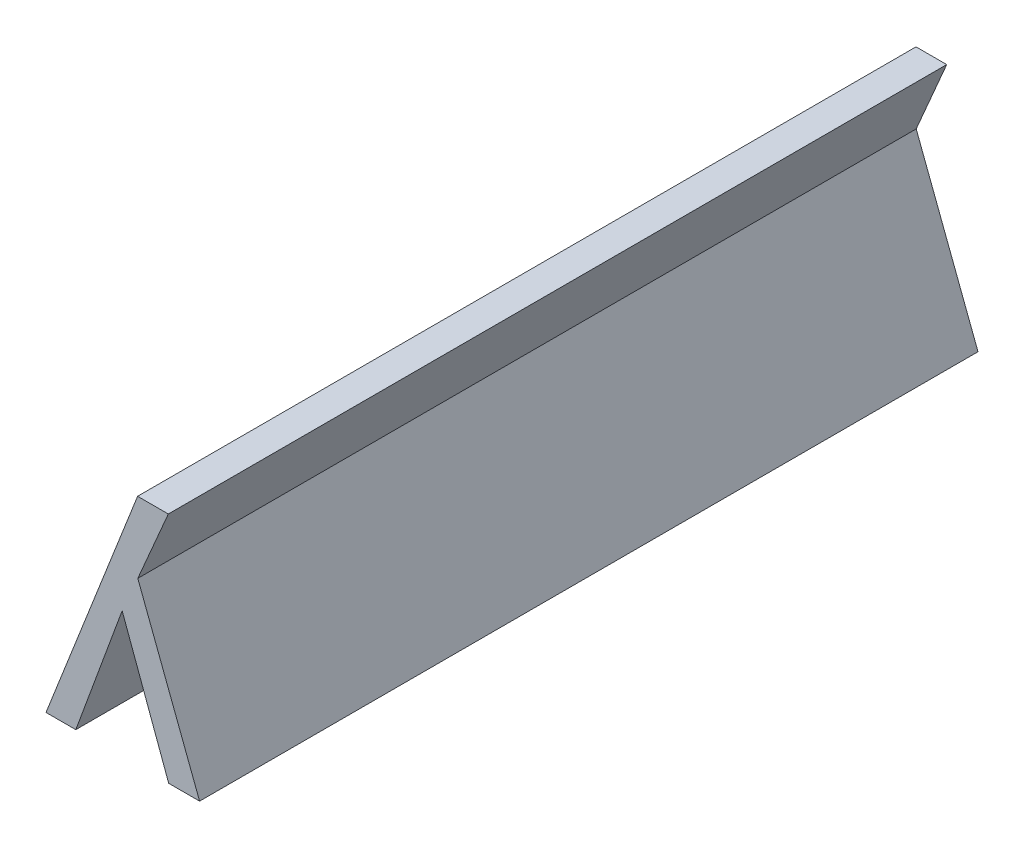
ISO-10303-21;
HEADER;
FILE_DESCRIPTION(('STEP AP214'),'2;1');
FILE_NAME('part.step','',(''),(''),'','','');
FILE_SCHEMA(('AUTOMOTIVE_DESIGN { 1 0 10303 214 1 1 1 1 }'));
ENDSEC;
DATA;
#1=APPLICATION_CONTEXT('core data for automotive mechanical design processes');
#2=APPLICATION_PROTOCOL_DEFINITION('international standard','automotive_design',2000,#1);
#3=PRODUCT_CONTEXT('',#1,'mechanical');
#4=PRODUCT('Part','Part','',(#3));
#5=PRODUCT_RELATED_PRODUCT_CATEGORY('part','',(#4));
#6=PRODUCT_DEFINITION_FORMATION('','',#4);
#7=PRODUCT_DEFINITION_CONTEXT('part definition',#1,'design');
#8=PRODUCT_DEFINITION('design','',#6,#7);
#9=PRODUCT_DEFINITION_SHAPE('','',#8);
#10=(LENGTH_UNIT() NAMED_UNIT(*) SI_UNIT(.MILLI.,.METRE.));
#11=(NAMED_UNIT(*) PLANE_ANGLE_UNIT() SI_UNIT($,.RADIAN.));
#12=(NAMED_UNIT(*) SI_UNIT($,.STERADIAN.) SOLID_ANGLE_UNIT());
#13=UNCERTAINTY_MEASURE_WITH_UNIT(LENGTH_MEASURE(1.E-05),#10,'distance_accuracy_value','');
#14=(GEOMETRIC_REPRESENTATION_CONTEXT(3) GLOBAL_UNCERTAINTY_ASSIGNED_CONTEXT((#13)) GLOBAL_UNIT_ASSIGNED_CONTEXT((#10,
#11,#12)) REPRESENTATION_CONTEXT('',''));
#15=CARTESIAN_POINT('',(0.,0.,0.));
#16=DIRECTION('',(0.,0.,1.));
#17=DIRECTION('',(1.,0.,0.));
#18=AXIS2_PLACEMENT_3D('',#15,#16,#17);
#19=CARTESIAN_POINT('',(4.983667851415,3.55349573247,0.));
#20=DIRECTION('',(0.938669759516636,-0.344817462679866,0.));
#21=DIRECTION('',(0.344817462679866,0.938669759516636,0.));
#22=AXIS2_PLACEMENT_3D('',#19,#20,#21);
#23=PLANE('',#22);
#24=DIRECTION('',(0.344817462672268,0.938669759519427,0.));
#25=VECTOR('',#24,1.);
#26=CARTESIAN_POINT('',(4.983667851415,3.55349573247,0.1));
#27=LINE('',#26,#25);
#28=CARTESIAN_POINT('',(4.983667851415,3.55349573247,0.1));
#29=VERTEX_POINT('',#28);
#30=CARTESIAN_POINT('',(4.98962273050806,3.56970623666798,0.1));
#31=VERTEX_POINT('',#30);
#32=EDGE_CURVE('E122',#29,#31,#27,.T.);
#33=ORIENTED_EDGE('',*,*,#32,.F.);
#34=DIRECTION('',(0.,0.,-1.));
#35=VECTOR('',#34,1.);
#36=CARTESIAN_POINT('',(4.983667851415,3.55349573247,0.));
#37=LINE('',#36,#35);
#38=CARTESIAN_POINT('',(4.983667851415,3.55349573247,0.));
#39=VERTEX_POINT('',#38);
#40=EDGE_CURVE('E87',#39,#29,#37,.F.);
#41=ORIENTED_EDGE('',*,*,#40,.F.);
#42=DIRECTION('',(0.344817462672268,0.938669759519427,0.));
#43=VECTOR('',#42,1.);
#44=CARTESIAN_POINT('',(4.983667851415,3.55349573247,0.));
#45=LINE('',#44,#43);
#46=CARTESIAN_POINT('',(4.98962273050806,3.56970623666798,0.));
#47=VERTEX_POINT('',#46);
#48=EDGE_CURVE('E84',#39,#47,#45,.T.);
#49=ORIENTED_EDGE('',*,*,#48,.T.);
#50=DIRECTION('',(0.,0.,1.));
#51=VECTOR('',#50,1.);
#52=CARTESIAN_POINT('',(4.989622730508,3.569706236668,0.));
#53=LINE('',#52,#51);
#54=EDGE_CURVE('E20',#31,#47,#53,.F.);
#55=ORIENTED_EDGE('',*,*,#54,.F.);
#56=EDGE_LOOP('',(#33,#41,#49,#55));
#57=FACE_BOUND('',#56,.T.);
#58=ADVANCED_FACE('F17',(#57),#23,.T.);
#59=CARTESIAN_POINT('',(4.989622730508,3.569706236668,0.));
#60=DIRECTION('',(-0.938226310403873,-0.346022239842953,0.));
#61=DIRECTION('',(0.346022239842953,-0.938226310403873,0.));
#62=AXIS2_PLACEMENT_3D('',#59,#60,#61);
#63=PLANE('',#62);
#64=DIRECTION('',(0.346022239856402,-0.938226310398914,0.));
#65=VECTOR('',#64,1.);
#66=CARTESIAN_POINT('',(4.989622730508,3.569706236668,0.1));
#67=LINE('',#66,#65);
#68=CARTESIAN_POINT('',(4.99560124007388,3.55349573246996,0.1));
#69=VERTEX_POINT('',#68);
#70=EDGE_CURVE('E94',#31,#69,#67,.T.);
#71=ORIENTED_EDGE('',*,*,#70,.F.);
#72=ORIENTED_EDGE('',*,*,#54,.T.);
#73=DIRECTION('',(0.346022239856402,-0.938226310398914,0.));
#74=VECTOR('',#73,1.);
#75=CARTESIAN_POINT('',(4.989622730508,3.569706236668,0.));
#76=LINE('',#75,#74);
#77=CARTESIAN_POINT('',(4.99560124007388,3.55349573246996,0.));
#78=VERTEX_POINT('',#77);
#79=EDGE_CURVE('E79',#47,#78,#76,.T.);
#80=ORIENTED_EDGE('',*,*,#79,.T.);
#81=DIRECTION('',(0.,0.,-1.));
#82=VECTOR('',#81,1.);
#83=CARTESIAN_POINT('',(4.995601240074,3.55349573247,0.));
#84=LINE('',#83,#82);
#85=EDGE_CURVE('E96',#69,#78,#84,.T.);
#86=ORIENTED_EDGE('',*,*,#85,.F.);
#87=EDGE_LOOP('',(#71,#72,#80,#86));
#88=FACE_BOUND('',#87,.T.);
#89=ADVANCED_FACE('F92',(#88),#63,.T.);
#90=CARTESIAN_POINT('',(4.995601240074,3.55349573247,0.));
#91=DIRECTION('',(0.,-1.,0.));
#92=DIRECTION('',(0.,0.,-1.));
#93=AXIS2_PLACEMENT_3D('',#90,#91,#92);
#94=PLANE('',#93);
#95=DIRECTION('',(1.,0.,0.));
#96=VECTOR('',#95,1.);
#97=CARTESIAN_POINT('',(4.990205851932,3.55349573247,0.1));
#98=LINE('',#97,#96);
#99=CARTESIAN_POINT('',(4.999571159469,3.55349573247,0.1));
#100=VERTEX_POINT('',#99);
#101=EDGE_CURVE('E115',#69,#100,#98,.T.);
#102=ORIENTED_EDGE('',*,*,#101,.F.);
#103=ORIENTED_EDGE('',*,*,#85,.T.);
#104=DIRECTION('',(1.,0.,0.));
#105=VECTOR('',#104,1.);
#106=CARTESIAN_POINT('',(4.990205851932,3.55349573247,0.));
#107=LINE('',#106,#105);
#108=CARTESIAN_POINT('',(4.999571159469,3.55349573247,0.));
#109=VERTEX_POINT('',#108);
#110=EDGE_CURVE('E101',#78,#109,#107,.T.);
#111=ORIENTED_EDGE('',*,*,#110,.T.);
#112=DIRECTION('',(0.,0.,1.));
#113=VECTOR('',#112,1.);
#114=CARTESIAN_POINT('',(4.999571159469,3.55349573247,0.));
#115=LINE('',#114,#113);
#116=EDGE_CURVE('E109',#100,#109,#115,.F.);
#117=ORIENTED_EDGE('',*,*,#116,.F.);
#118=EDGE_LOOP('',(#102,#103,#111,#117));
#119=FACE_BOUND('',#118,.T.);
#120=ADVANCED_FACE('F113',(#119),#94,.T.);
#121=CARTESIAN_POINT('',(4.999571159469,3.55349573247,0.));
#122=DIRECTION('',(0.93435326073488,0.356348122141954,0.));
#123=DIRECTION('',(-0.356348122141954,0.93435326073488,0.));
#124=AXIS2_PLACEMENT_3D('',#121,#122,#123);
#125=PLANE('',#124);
#126=DIRECTION('',(-0.356348122114344,0.93435326074541,0.));
#127=VECTOR('',#126,1.);
#128=CARTESIAN_POINT('',(4.999571159469,3.55349573247,0.1));
#129=LINE('',#128,#127);
#130=CARTESIAN_POINT('',(4.99163132067869,3.57431417882288,0.1));
#131=VERTEX_POINT('',#130);
#132=EDGE_CURVE('E118',#100,#131,#129,.T.);
#133=ORIENTED_EDGE('',*,*,#132,.F.);
#134=ORIENTED_EDGE('',*,*,#116,.T.);
#135=DIRECTION('',(-0.356348122114344,0.93435326074541,0.));
#136=VECTOR('',#135,1.);
#137=CARTESIAN_POINT('',(4.999571159469,3.55349573247,0.));
#138=LINE('',#137,#136);
#139=CARTESIAN_POINT('',(4.99163132067869,3.57431417882288,0.));
#140=VERTEX_POINT('',#139);
#141=EDGE_CURVE('E103',#109,#140,#138,.T.);
#142=ORIENTED_EDGE('',*,*,#141,.T.);
#143=DIRECTION('',(0.,0.,1.));
#144=VECTOR('',#143,1.);
#145=CARTESIAN_POINT('',(4.991631320679,3.574314178823,0.));
#146=LINE('',#145,#144);
#147=EDGE_CURVE('E90',#131,#140,#146,.F.);
#148=ORIENTED_EDGE('',*,*,#147,.F.);
#149=EDGE_LOOP('',(#133,#134,#142,#148));
#150=FACE_BOUND('',#149,.T.);
#151=ADVANCED_FACE('F134',(#150),#125,.T.);
#152=CARTESIAN_POINT('',(4.991631320679,3.574314178823,0.));
#153=DIRECTION('',(0.918651913198258,-0.395067921220111,0.));
#154=DIRECTION('',(0.395067921220111,0.918651913198258,0.));
#155=AXIS2_PLACEMENT_3D('',#152,#153,#154);
#156=PLANE('',#155);
#157=DIRECTION('',(0.395067921179138,0.918651913215879,0.));
#158=VECTOR('',#157,1.);
#159=CARTESIAN_POINT('',(4.991631320679,3.574314178823,0.1));
#160=LINE('',#159,#158);
#161=CARTESIAN_POINT('',(4.9955539791291,3.58343554124396,0.1));
#162=VERTEX_POINT('',#161);
#163=EDGE_CURVE('E140',#131,#162,#160,.T.);
#164=ORIENTED_EDGE('',*,*,#163,.F.);
#165=ORIENTED_EDGE('',*,*,#147,.T.);
#166=DIRECTION('',(0.395067921179138,0.918651913215879,0.));
#167=VECTOR('',#166,1.);
#168=CARTESIAN_POINT('',(4.991631320679,3.574314178823,0.));
#169=LINE('',#168,#167);
#170=CARTESIAN_POINT('',(4.9955539791291,3.58343554124396,0.));
#171=VERTEX_POINT('',#170);
#172=EDGE_CURVE('E132',#140,#171,#169,.T.);
#173=ORIENTED_EDGE('',*,*,#172,.T.);
#174=DIRECTION('',(0.,0.,1.));
#175=VECTOR('',#174,1.);
#176=CARTESIAN_POINT('',(4.995553979129,3.583435541244,0.));
#177=LINE('',#176,#175);
#178=EDGE_CURVE('E148',#162,#171,#177,.F.);
#179=ORIENTED_EDGE('',*,*,#178,.F.);
#180=EDGE_LOOP('',(#164,#165,#173,#179));
#181=FACE_BOUND('',#180,.T.);
#182=ADVANCED_FACE('F138',(#181),#156,.T.);
#183=CARTESIAN_POINT('',(4.990205851932,3.565817438477,0.));
#184=DIRECTION('',(0.,0.,1.));
#185=DIRECTION('',(1.,0.,0.));
#186=AXIS2_PLACEMENT_3D('',#183,#184,#185);
#187=PLANE('',#186);
#188=DIRECTION('',(1.,0.,0.));
#189=VECTOR('',#188,1.);
#190=CARTESIAN_POINT('',(4.995553979129,3.583435541244,0.));
#191=LINE('',#190,#189);
#192=CARTESIAN_POINT('',(4.991607690206,3.583435541244,0.));
#193=VERTEX_POINT('',#192);
#194=EDGE_CURVE('E142',#171,#193,#191,.F.);
#195=ORIENTED_EDGE('',*,*,#194,.F.);
#196=ORIENTED_EDGE('',*,*,#172,.F.);
#197=ORIENTED_EDGE('',*,*,#141,.F.);
#198=ORIENTED_EDGE('',*,*,#110,.F.);
#199=ORIENTED_EDGE('',*,*,#79,.F.);
#200=ORIENTED_EDGE('',*,*,#48,.F.);
#201=DIRECTION('',(1.,0.,0.));
#202=VECTOR('',#201,1.);
#203=CARTESIAN_POINT('',(4.979839714855,3.55349573247,0.));
#204=LINE('',#203,#202);
#205=CARTESIAN_POINT('',(4.97983971485505,3.55349573246998,0.));
#206=VERTEX_POINT('',#205);
#207=EDGE_CURVE('E130',#206,#39,#204,.T.);
#208=ORIENTED_EDGE('',*,*,#207,.F.);
#209=DIRECTION('',(-0.365811454359092,-0.930688981271233,0.));
#210=VECTOR('',#209,1.);
#211=CARTESIAN_POINT('',(4.991607690206,3.583435541244,0.));
#212=LINE('',#211,#210);
#213=EDGE_CURVE('E145',#193,#206,#212,.T.);
#214=ORIENTED_EDGE('',*,*,#213,.F.);
#215=EDGE_LOOP('',(#195,#196,#197,#198,#199,#200,#208,#214));
#216=FACE_BOUND('',#215,.T.);
#217=ADVANCED_FACE('F99',(#216),#187,.F.);
#218=CARTESIAN_POINT('',(4.979839714855,3.55349573247,0.));
#219=DIRECTION('',(0.,-1.,0.));
#220=DIRECTION('',(0.,0.,-1.));
#221=AXIS2_PLACEMENT_3D('',#218,#219,#220);
#222=PLANE('',#221);
#223=DIRECTION('',(1.,0.,0.));
#224=VECTOR('',#223,1.);
#225=CARTESIAN_POINT('',(4.990205851932,3.55349573247,0.1));
#226=LINE('',#225,#224);
#227=CARTESIAN_POINT('',(4.97983971485505,3.55349573246998,0.1));
#228=VERTEX_POINT('',#227);
#229=EDGE_CURVE('E124',#228,#29,#226,.T.);
#230=ORIENTED_EDGE('',*,*,#229,.F.);
#231=DIRECTION('',(0.,0.,1.));
#232=VECTOR('',#231,1.);
#233=CARTESIAN_POINT('',(4.97983971485518,3.55349573246993,0.));
#234=LINE('',#233,#232);
#235=EDGE_CURVE('E151',#206,#228,#234,.T.);
#236=ORIENTED_EDGE('',*,*,#235,.F.);
#237=ORIENTED_EDGE('',*,*,#207,.T.);
#238=ORIENTED_EDGE('',*,*,#40,.T.);
#239=EDGE_LOOP('',(#230,#236,#237,#238));
#240=FACE_BOUND('',#239,.T.);
#241=ADVANCED_FACE('F163',(#240),#222,.T.);
#242=CARTESIAN_POINT('',(4.990205851932,3.565817438477,0.1));
#243=DIRECTION('',(0.,0.,1.));
#244=DIRECTION('',(1.,0.,0.));
#245=AXIS2_PLACEMENT_3D('',#242,#243,#244);
#246=PLANE('',#245);
#247=ORIENTED_EDGE('',*,*,#163,.T.);
#248=DIRECTION('',(1.,0.,0.));
#249=VECTOR('',#248,1.);
#250=CARTESIAN_POINT('',(4.995553979129,3.583435541244,0.1));
#251=LINE('',#250,#249);
#252=CARTESIAN_POINT('',(4.991607690206,3.583435541244,0.1));
#253=VERTEX_POINT('',#252);
#254=EDGE_CURVE('E35',#253,#162,#251,.T.);
#255=ORIENTED_EDGE('',*,*,#254,.F.);
#256=DIRECTION('',(-0.365811454359092,-0.930688981271233,0.));
#257=VECTOR('',#256,1.);
#258=CARTESIAN_POINT('',(4.991607690206,3.583435541244,0.1));
#259=LINE('',#258,#257);
#260=EDGE_CURVE('E26',#228,#253,#259,.F.);
#261=ORIENTED_EDGE('',*,*,#260,.F.);
#262=ORIENTED_EDGE('',*,*,#229,.T.);
#263=ORIENTED_EDGE('',*,*,#32,.T.);
#264=ORIENTED_EDGE('',*,*,#70,.T.);
#265=ORIENTED_EDGE('',*,*,#101,.T.);
#266=ORIENTED_EDGE('',*,*,#132,.T.);
#267=EDGE_LOOP('',(#247,#255,#261,#262,#263,#264,#265,#266));
#268=FACE_BOUND('',#267,.T.);
#269=ADVANCED_FACE('F120',(#268),#246,.T.);
#270=CARTESIAN_POINT('',(4.995553979129,3.583435541244,0.));
#271=DIRECTION('',(0.,1.,0.));
#272=DIRECTION('',(0.,0.,1.));
#273=AXIS2_PLACEMENT_3D('',#270,#271,#272);
#274=PLANE('',#273);
#275=ORIENTED_EDGE('',*,*,#254,.T.);
#276=ORIENTED_EDGE('',*,*,#178,.T.);
#277=ORIENTED_EDGE('',*,*,#194,.T.);
#278=DIRECTION('',(0.,0.,1.));
#279=VECTOR('',#278,1.);
#280=CARTESIAN_POINT('',(4.991607690206,3.583435541244,0.));
#281=LINE('',#280,#279);
#282=EDGE_CURVE('E11',#253,#193,#281,.F.);
#283=ORIENTED_EDGE('',*,*,#282,.F.);
#284=EDGE_LOOP('',(#275,#276,#277,#283));
#285=FACE_BOUND('',#284,.T.);
#286=ADVANCED_FACE('F149',(#285),#274,.T.);
#287=CARTESIAN_POINT('',(4.991607690206,3.583435541244,0.));
#288=DIRECTION('',(-0.930688981271233,0.365811454359092,0.));
#289=DIRECTION('',(-0.365811454359092,-0.930688981271233,0.));
#290=AXIS2_PLACEMENT_3D('',#287,#288,#289);
#291=PLANE('',#290);
#292=ORIENTED_EDGE('',*,*,#260,.T.);
#293=ORIENTED_EDGE('',*,*,#282,.T.);
#294=ORIENTED_EDGE('',*,*,#213,.T.);
#295=ORIENTED_EDGE('',*,*,#235,.T.);
#296=EDGE_LOOP('',(#292,#293,#294,#295));
#297=FACE_BOUND('',#296,.T.);
#298=ADVANCED_FACE('F160',(#297),#291,.T.);
#299=CLOSED_SHELL('',(#58,#89,#120,#151,#182,#217,#241,#269,#286,#298));
#300=MANIFOLD_SOLID_BREP('B1',#299);
#301=ADVANCED_BREP_SHAPE_REPRESENTATION('',(#18,#300),#14);
#302=SHAPE_DEFINITION_REPRESENTATION(#9,#301);
ENDSEC;
END-ISO-10303-21;
